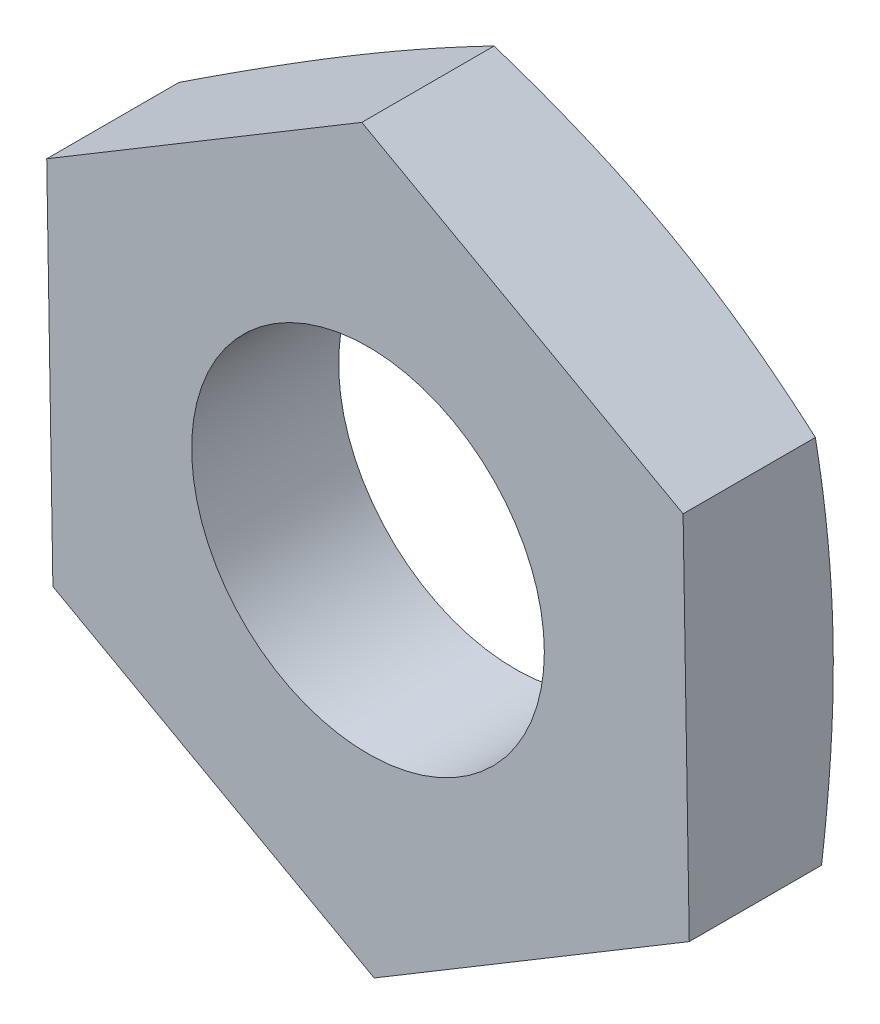
ISO-10303-21;
HEADER;
FILE_DESCRIPTION(('STEP AP214'),'2;1');
FILE_NAME('part.step','',(''),(''),'','','');
FILE_SCHEMA(('AUTOMOTIVE_DESIGN { 1 0 10303 214 1 1 1 1 }'));
ENDSEC;
DATA;
#1=APPLICATION_CONTEXT('core data for automotive mechanical design processes');
#2=APPLICATION_PROTOCOL_DEFINITION('international standard','automotive_design',2000,#1);
#3=PRODUCT_CONTEXT('',#1,'mechanical');
#4=PRODUCT('Part','Part','',(#3));
#5=PRODUCT_RELATED_PRODUCT_CATEGORY('part','',(#4));
#6=PRODUCT_DEFINITION_FORMATION('','',#4);
#7=PRODUCT_DEFINITION_CONTEXT('part definition',#1,'design');
#8=PRODUCT_DEFINITION('design','',#6,#7);
#9=PRODUCT_DEFINITION_SHAPE('','',#8);
#10=(LENGTH_UNIT() NAMED_UNIT(*) SI_UNIT(.MILLI.,.METRE.));
#11=(NAMED_UNIT(*) PLANE_ANGLE_UNIT() SI_UNIT($,.RADIAN.));
#12=(NAMED_UNIT(*) SI_UNIT($,.STERADIAN.) SOLID_ANGLE_UNIT());
#13=UNCERTAINTY_MEASURE_WITH_UNIT(LENGTH_MEASURE(1.E-05),#10,'distance_accuracy_value','');
#14=(GEOMETRIC_REPRESENTATION_CONTEXT(3) GLOBAL_UNCERTAINTY_ASSIGNED_CONTEXT((#13)) GLOBAL_UNIT_ASSIGNED_CONTEXT((#10,
#11,#12)) REPRESENTATION_CONTEXT('',''));
#15=CARTESIAN_POINT('',(0.,0.,0.));
#16=DIRECTION('',(0.,0.,1.));
#17=DIRECTION('',(1.,0.,0.));
#18=AXIS2_PLACEMENT_3D('',#15,#16,#17);
#19=CARTESIAN_POINT('',(0.,0.,0.));
#20=DIRECTION('',(0.,0.,1.));
#21=DIRECTION('',(1.,0.,0.));
#22=AXIS2_PLACEMENT_3D('',#19,#20,#21);
#23=PLANE('',#22);
#24=CARTESIAN_POINT('',(-2.16506350946111,13.8385519997513,0.));
#25=DIRECTION('',(0.,0.,1.));
#26=DIRECTION('',(1.,0.,0.));
#27=AXIS2_PLACEMENT_3D('',#24,#25,#26);
#28=CIRCLE('',#27,6.);
#29=CARTESIAN_POINT('',(3.8349364905389,13.8385519997513,0.));
#30=VERTEX_POINT('',#29);
#31=EDGE_CURVE('E202',#30,#30,#28,.T.);
#32=ORIENTED_EDGE('',*,*,#31,.T.);
#33=EDGE_LOOP('',(#32));
#34=FACE_BOUND('',#33,.T.);
#35=CARTESIAN_POINT('',(-2.16416599208997,13.8401687512004,0.));
#36=DIRECTION('',(0.,0.,-1.));
#37=DIRECTION('',(-1.,0.,0.));
#38=AXIS2_PLACEMENT_3D('',#35,#36,#37);
#39=CIRCLE('',#38,10.825);
#40=CARTESIAN_POINT('',(3.08988609620037,23.3046054303447,0.));
#41=VERTEX_POINT('',#40);
#42=EDGE_CURVE('E255',#41,#41,#39,.T.);
#43=ORIENTED_EDGE('',*,*,#42,.T.);
#44=EDGE_LOOP('',(#43));
#45=FACE_BOUND('',#44,.T.);
#46=ADVANCED_FACE('F33',(#34,#45),#23,.F.);
#47=CARTESIAN_POINT('',(0.,0.,5.));
#48=DIRECTION('',(0.,0.,1.));
#49=DIRECTION('',(1.,0.,0.));
#50=AXIS2_PLACEMENT_3D('',#47,#48,#49);
#51=PLANE('',#50);
#52=DIRECTION('',(0.0168199314832365,-0.999858534946269,0.));
#53=VECTOR('',#52,1.);
#54=CARTESIAN_POINT('',(-13.0955205020941,19.9064451385644,5.));
#55=LINE('',#54,#53);
#56=CARTESIAN_POINT('',(-13.0955205020941,19.9064451385644,5.));
#57=VERTEX_POINT('',#56);
#58=CARTESIAN_POINT('',(-12.8852416114391,7.40644513856439,5.));
#59=VERTEX_POINT('',#58);
#60=EDGE_CURVE('E151',#57,#59,#55,.T.);
#61=ORIENTED_EDGE('',*,*,#60,.T.);
#62=DIRECTION('',(0.874312857195778,-0.485362779518738,0.));
#63=VECTOR('',#62,1.);
#64=CARTESIAN_POINT('',(-12.8852416114391,7.40644513856439,5.));
#65=LINE('',#64,#63);
#66=CARTESIAN_POINT('',(-1.95478461880609,1.33855199975125,5.));
#67=VERTEX_POINT('',#66);
#68=EDGE_CURVE('E145',#59,#67,#65,.T.);
#69=ORIENTED_EDGE('',*,*,#68,.T.);
#70=DIRECTION('',(0.857492925712541,0.514495755427531,0.));
#71=VECTOR('',#70,1.);
#72=CARTESIAN_POINT('',(-1.95478461880609,1.33855199975125,5.));
#73=LINE('',#72,#71);
#74=CARTESIAN_POINT('',(8.76539348317189,7.77065886093812,5.));
#75=VERTEX_POINT('',#74);
#76=EDGE_CURVE('E245',#67,#75,#73,.T.);
#77=ORIENTED_EDGE('',*,*,#76,.T.);
#78=DIRECTION('',(-0.0168199314832367,0.999858534946269,0.));
#79=VECTOR('',#78,1.);
#80=CARTESIAN_POINT('',(8.76539348317189,7.77065886093812,5.));
#81=LINE('',#80,#79);
#82=CARTESIAN_POINT('',(8.55511459251686,20.2706588609381,5.));
#83=VERTEX_POINT('',#82);
#84=EDGE_CURVE('E129',#75,#83,#81,.T.);
#85=ORIENTED_EDGE('',*,*,#84,.T.);
#86=DIRECTION('',(-0.874312857195778,0.485362779518738,0.));
#87=VECTOR('',#86,1.);
#88=CARTESIAN_POINT('',(8.55511459251686,20.2706588609381,5.));
#89=LINE('',#88,#87);
#90=CARTESIAN_POINT('',(-2.37534240011613,26.3385519997513,5.));
#91=VERTEX_POINT('',#90);
#92=EDGE_CURVE('E242',#83,#91,#89,.T.);
#93=ORIENTED_EDGE('',*,*,#92,.T.);
#94=DIRECTION('',(-0.857492925712541,-0.514495755427531,0.));
#95=VECTOR('',#94,1.);
#96=CARTESIAN_POINT('',(-2.37534240011613,26.3385519997513,5.));
#97=LINE('',#96,#95);
#98=EDGE_CURVE('E236',#91,#57,#97,.T.);
#99=ORIENTED_EDGE('',*,*,#98,.T.);
#100=EDGE_LOOP('',(#61,#69,#77,#85,#93,#99));
#101=FACE_BOUND('',#100,.T.);
#102=CARTESIAN_POINT('',(-2.16506350946111,13.8385519997513,5.));
#103=DIRECTION('',(0.,0.,1.));
#104=DIRECTION('',(1.,0.,0.));
#105=AXIS2_PLACEMENT_3D('',#102,#103,#104);
#106=CIRCLE('',#105,6.);
#107=CARTESIAN_POINT('',(3.8349364905389,13.8385519997513,5.));
#108=VERTEX_POINT('',#107);
#109=EDGE_CURVE('E203',#108,#108,#106,.T.);
#110=ORIENTED_EDGE('',*,*,#109,.F.);
#111=EDGE_LOOP('',(#110));
#112=FACE_BOUND('',#111,.T.);
#113=ADVANCED_FACE('F216',(#101,#112),#51,.T.);
#114=CARTESIAN_POINT('',(-13.0955205020941,19.9064451385644,5.));
#115=DIRECTION('',(0.999858534946269,0.0168199314832365,0.));
#116=DIRECTION('',(-0.0168199314832365,0.999858534946269,0.));
#117=AXIS2_PLACEMENT_3D('',#114,#115,#116);
#118=PLANE('',#117);
#119=DIRECTION('',(0.,0.,-1.));
#120=VECTOR('',#119,1.);
#121=CARTESIAN_POINT('',(-13.0955205020941,19.9064451385644,5.));
#122=LINE('',#121,#120);
#123=CARTESIAN_POINT('',(-13.0955205020941,19.9064451385644,0.5));
#124=VERTEX_POINT('',#123);
#125=EDGE_CURVE('E238',#57,#124,#122,.T.);
#126=ORIENTED_EDGE('',*,*,#125,.T.);
#127=CARTESIAN_POINT('',(-13.0955238665563,19.9066451385644,0.50002985697749));
#128=CARTESIAN_POINT('',(-13.0867995313924,19.3880282236201,0.422684675104094));
#129=CARTESIAN_POINT('',(-13.0780556906255,18.8682518007651,0.352429876257374));
#130=CARTESIAN_POINT('',(-13.060529807607,17.8264280730086,0.228954287126737));
#131=CARTESIAN_POINT('',(-13.0517477482138,17.3043797491228,0.175742163456824));
#132=CARTESIAN_POINT('',(-13.0342111932582,16.261921629519,0.0895651849645063));
#133=CARTESIAN_POINT('',(-13.0254568789745,15.7415226098837,0.0564733955933078));
#134=CARTESIAN_POINT('',(-13.0079344601726,14.6999048120091,0.0121028578918939));
#135=CARTESIAN_POINT('',(-12.9991663595205,14.1786862635855,0.000818813274274054));
#136=CARTESIAN_POINT('',(-12.9816301687857,13.1362497950373,0.000835420746450474));
#137=CARTESIAN_POINT('',(-12.9728620787031,12.6150318749124,0.0121360615570773));
#138=CARTESIAN_POINT('',(-12.9553396915242,11.5734159568656,0.0565386514262699));
#139=CARTESIAN_POINT('',(-12.9465853982971,11.0530181889389,0.0896458970614779));
#140=CARTESIAN_POINT('',(-12.9290488917792,10.0105629487034,0.17585195486682));
#141=CARTESIAN_POINT('',(-12.9202668598116,9.48851625513203,0.229077690330715));
#142=CARTESIAN_POINT('',(-12.9027410354596,8.44669601479544,0.352578329386825));
#143=CARTESIAN_POINT('',(-12.8939972259279,7.92692144871135,0.422844565314163));
#144=CARTESIAN_POINT('',(-12.8852729213389,7.40830635129441,0.500200000000001));
#145=B_SPLINE_CURVE_WITH_KNOTS('',3,(#127,#128,#129,#130,#131,#132,#133,#134,#135,#136,#137,
#138,#139,#140,#141,#142,#143,#144),.UNSPECIFIED.,.F.,.F.,(4,2,2,2,2,2,2,2,4),(0.,
1.57337984366562,3.14755852346243,4.71170014225027,6.27546184164752,7.83922276007622,
9.40336363840265,10.9775416645261,12.5509206569255),.UNSPECIFIED.);
#146=CARTESIAN_POINT('',(-12.8852954878106,7.40964781212835,0.5));
#147=VERTEX_POINT('',#146);
#148=EDGE_CURVE('E63',#124,#147,#145,.T.);
#149=ORIENTED_EDGE('',*,*,#148,.T.);
#150=DIRECTION('',(0.0168199314832365,-0.999858534946269,0.));
#151=VECTOR('',#150,1.);
#152=CARTESIAN_POINT('',(-13.0955205020941,19.9064451385644,0.5));
#153=LINE('',#152,#151);
#154=CARTESIAN_POINT('',(-12.8852416114391,7.40644513856439,0.5));
#155=VERTEX_POINT('',#154);
#156=EDGE_CURVE('E152',#147,#155,#153,.T.);
#157=ORIENTED_EDGE('',*,*,#156,.T.);
#158=DIRECTION('',(0.,0.,-1.));
#159=VECTOR('',#158,1.);
#160=CARTESIAN_POINT('',(-12.8852416114391,7.40644513856439,5.));
#161=LINE('',#160,#159);
#162=EDGE_CURVE('E48',#59,#155,#161,.T.);
#163=ORIENTED_EDGE('',*,*,#162,.F.);
#164=ORIENTED_EDGE('',*,*,#60,.F.);
#165=EDGE_LOOP('',(#126,#149,#157,#163,#164));
#166=FACE_BOUND('',#165,.T.);
#167=ADVANCED_FACE('F35',(#166),#118,.F.);
#168=CARTESIAN_POINT('',(-12.8852416114391,7.40644513856439,5.));
#169=DIRECTION('',(0.485362779518738,0.874312857195778,0.));
#170=DIRECTION('',(-0.874312857195778,0.485362779518738,0.));
#171=AXIS2_PLACEMENT_3D('',#168,#169,#170);
#172=PLANE('',#171);
#173=ORIENTED_EDGE('',*,*,#162,.T.);
#174=DIRECTION('',(0.874312857195778,-0.485362779518738,0.));
#175=VECTOR('',#174,1.);
#176=CARTESIAN_POINT('',(-12.8852416114391,7.40644513856439,0.5));
#177=LINE('',#176,#175);
#178=CARTESIAN_POINT('',(-12.8824403587444,7.40489006158841,0.5));
#179=VERTEX_POINT('',#178);
#180=EDGE_CURVE('E143',#155,#179,#177,.T.);
#181=ORIENTED_EDGE('',*,*,#180,.T.);
#182=CARTESIAN_POINT('',(-12.8836136819032,7.40554141583187,0.5002));
#183=CARTESIAN_POINT('',(-12.4301911136307,7.15383010194462,0.422876824913314));
#184=CARTESIAN_POINT('',(-11.9757550818385,6.90155617769791,0.352642014883943));
#185=CARTESIAN_POINT('',(-11.0648982929762,6.39590653621412,0.229200372325145));
#186=CARTESIAN_POINT('',(-10.6084766459393,6.14253032492415,0.176002196908478));
#187=CARTESIAN_POINT('',(-9.69706510826565,5.63657272225372,0.0898448181855448));
#188=CARTESIAN_POINT('',(-9.24208463207512,5.38399655717377,0.0567587862919687));
#189=CARTESIAN_POINT('',(-8.33140700847794,4.87844637682721,0.012390430293197));
#190=CARTESIAN_POINT('',(-7.87571006180026,4.62547247299252,0.00110281653961971));
#191=CARTESIAN_POINT('',(-6.9643161684449,4.11952466532313,0.00110281653961985));
#192=CARTESIAN_POINT('',(-6.50861922176721,3.86655076148843,0.0123904302931973));
#193=CARTESIAN_POINT('',(-5.59794159817004,3.36100058114187,0.05675878629197));
#194=CARTESIAN_POINT('',(-5.1429611219795,3.10842441606193,0.089844818185547));
#195=CARTESIAN_POINT('',(-4.23154958430588,2.60246681339149,0.176002196908481));
#196=CARTESIAN_POINT('',(-3.77512793726893,2.34909060210152,0.229200372325147));
#197=CARTESIAN_POINT('',(-2.86427114840664,1.84344096061773,0.352642014883946));
#198=CARTESIAN_POINT('',(-2.40983511661443,1.59116703637102,0.422876824913317));
#199=CARTESIAN_POINT('',(-1.95641254834195,1.33945572248378,0.500200000000003));
#200=B_SPLINE_CURVE_WITH_KNOTS('',3,(#182,#183,#184,#185,#186,#187,#188,#189,#190,#191,#192,
#193,#194,#195,#196,#197,#198,#199),.UNSPECIFIED.,.F.,.F.,(4,2,2,2,2,2,2,2,4),(0.,
1.57311538337115,3.14702887668031,4.71091131489419,6.27441421051308,7.83791710613197,
9.40179954434585,10.975713037655,12.5488284210262),.UNSPECIFIED.);
#201=CARTESIAN_POINT('',(-1.9575858715008,1.34010707672725,0.5));
#202=VERTEX_POINT('',#201);
#203=EDGE_CURVE('E196',#179,#202,#200,.T.);
#204=ORIENTED_EDGE('',*,*,#203,.T.);
#205=CARTESIAN_POINT('',(-1.95478461880609,1.33855199975125,0.5));
#206=VERTEX_POINT('',#205);
#207=EDGE_CURVE('E158',#202,#206,#177,.T.);
#208=ORIENTED_EDGE('',*,*,#207,.T.);
#209=DIRECTION('',(0.,0.,-1.));
#210=VECTOR('',#209,1.);
#211=CARTESIAN_POINT('',(-1.95478461880609,1.33855199975125,5.));
#212=LINE('',#211,#210);
#213=EDGE_CURVE('E130',#67,#206,#212,.T.);
#214=ORIENTED_EDGE('',*,*,#213,.F.);
#215=ORIENTED_EDGE('',*,*,#68,.F.);
#216=EDGE_LOOP('',(#173,#181,#204,#208,#214,#215));
#217=FACE_BOUND('',#216,.T.);
#218=ADVANCED_FACE('F141',(#217),#172,.F.);
#219=CARTESIAN_POINT('',(-1.95478461880609,1.33855199975125,5.));
#220=DIRECTION('',(-0.514495755427531,0.857492925712541,0.));
#221=DIRECTION('',(-0.857492925712542,-0.514495755427531,0.));
#222=AXIS2_PLACEMENT_3D('',#219,#220,#221);
#223=PLANE('',#222);
#224=DIRECTION('',(0.857492925712542,0.514495755427531,0.));
#225=VECTOR('',#224,1.);
#226=CARTESIAN_POINT('',(-1.95478461880609,1.33855199975125,0.5));
#227=LINE('',#226,#225);
#228=CARTESIAN_POINT('',(-1.95203796032542,1.34019999483965,0.5));
#229=VERTEX_POINT('',#228);
#230=EDGE_CURVE('E126',#206,#229,#227,.T.);
#231=ORIENTED_EDGE('',*,*,#230,.T.);
#232=CARTESIAN_POINT('',(-1.95318841624998,1.33950972128492,0.500200000000005));
#233=CARTESIAN_POINT('',(-1.50841552128261,1.60637345826534,0.422844356453918));
#234=CARTESIAN_POINT('',(-1.06264824354395,1.87383382490854,0.352577950441473));
#235=CARTESIAN_POINT('',(-0.169165942782842,2.40992320536521,0.229077070746257));
#236=CARTESIAN_POINT('',(0.278549954431254,2.67855274369367,0.175851264827393));
#237=CARTESIAN_POINT('',(1.17257683568901,3.21496887244833,0.08964518964693));
#238=CARTESIAN_POINT('',(1.61887857565739,3.48274991642937,0.0565379957478577));
#239=CARTESIAN_POINT('',(2.5121856243692,4.01873414565646,0.0121356386944393));
#240=CARTESIAN_POINT('',(2.95919073586435,4.28693721255355,0.000835178890827336));
#241=CARTESIAN_POINT('',(3.8532014820175,4.82334366024545,0.000819054601660142));
#242=CARTESIAN_POINT('',(4.30020711667564,5.09154704104034,0.0121034010672146));
#243=CARTESIAN_POINT('',(5.19351573065525,5.62753220942811,0.0564746384946488));
#244=CARTESIAN_POINT('',(5.63981851287773,5.8953138787616,0.0895668258249717));
#245=CARTESIAN_POINT('',(6.53384779168371,6.4317314460452,0.175744667754441));
#246=CARTESIAN_POINT('',(6.98156504640238,6.7003617988764,0.228957257918732));
#247=CARTESIAN_POINT('',(7.87505025101229,7.23645292164235,0.352433816532551));
#248=CARTESIAN_POINT('',(8.32081907481651,7.50391421592488,0.422689118238471));
#249=CARTESIAN_POINT('',(8.76559348317189,7.77077886093812,0.500034807293));
#250=B_SPLINE_CURVE_WITH_KNOTS('',3,(#232,#233,#234,#235,#236,#237,#238,#239,#240,#241,#242,
#243,#244,#245,#246,#247,#248,#249),.UNSPECIFIED.,.F.,.F.,(4,2,2,2,2,2,2,2,4),(0.,
1.57338323193201,3.14756550419713,4.71171055662652,6.27547564518754,7.83924149200022,
9.4033872633525,10.9775701702768,12.550954228713),.UNSPECIFIED.);
#251=CARTESIAN_POINT('',(8.76539347857256,7.77065913434451,0.5));
#252=VERTEX_POINT('',#251);
#253=EDGE_CURVE('E111',#229,#252,#250,.T.);
#254=ORIENTED_EDGE('',*,*,#253,.T.);
#255=DIRECTION('',(0.,0.,-1.));
#256=VECTOR('',#255,1.);
#257=CARTESIAN_POINT('',(8.76539348317189,7.77065886093812,5.));
#258=LINE('',#257,#256);
#259=EDGE_CURVE('E123',#75,#252,#258,.T.);
#260=ORIENTED_EDGE('',*,*,#259,.F.);
#261=ORIENTED_EDGE('',*,*,#76,.F.);
#262=ORIENTED_EDGE('',*,*,#213,.T.);
#263=EDGE_LOOP('',(#231,#254,#260,#261,#262));
#264=FACE_BOUND('',#263,.T.);
#265=ADVANCED_FACE('F121',(#264),#223,.F.);
#266=CARTESIAN_POINT('',(8.76539348317189,7.77065886093812,5.));
#267=DIRECTION('',(-0.999858534946269,-0.0168199314832367,0.));
#268=DIRECTION('',(0.0168199314832367,-0.999858534946269,0.));
#269=AXIS2_PLACEMENT_3D('',#266,#267,#268);
#270=PLANE('',#269);
#271=ORIENTED_EDGE('',*,*,#259,.T.);
#272=CARTESIAN_POINT('',(8.76539684763414,7.77045886093812,0.500029872258444));
#273=CARTESIAN_POINT('',(8.75667114727167,8.2891569299224,0.422633147690996));
#274=CARTESIAN_POINT('',(8.74792593243303,8.80901503428311,0.352326063072702));
#275=CARTESIAN_POINT('',(8.73039726739171,9.85100413900928,0.228747427893326));
#276=CARTESIAN_POINT('',(8.72161380000619,10.3731361608066,0.175484558915394));
#277=CARTESIAN_POINT('',(8.7040744376521,11.4157611658331,0.0892112975061097));
#278=CARTESIAN_POINT('',(8.6953187242878,11.9362433536207,0.056073864501526));
#279=CARTESIAN_POINT('',(8.67779347707662,12.9780292859005,0.0116203937621829));
#280=CARTESIAN_POINT('',(8.66902394710927,13.4993327997739,0.000299050381241432));
#281=CARTESIAN_POINT('',(8.65148485748826,14.5419415922196,0.00025243043891354));
#282=CARTESIAN_POINT('',(8.64271529783457,15.0632468707935,0.011527185576569));
#283=CARTESIAN_POINT('',(8.62518996181266,16.1050380824148,0.0558906827179348));
#284=CARTESIAN_POINT('',(8.6164341893155,16.6255237853475,0.0889847295557887));
#285=CARTESIAN_POINT('',(8.5988946909454,17.668156875827,0.17517636756357));
#286=CARTESIAN_POINT('',(8.59011114655131,18.1902934753881,0.228401030936762));
#287=CARTESIAN_POINT('',(8.57258231678901,19.2322923719309,0.351909359105747));
#288=CARTESIAN_POINT('',(8.56383701425377,19.7521556894041,0.422184345268381));
#289=CARTESIAN_POINT('',(8.55511122805461,20.2708588609381,0.499552296644255));
#290=B_SPLINE_CURVE_WITH_KNOTS('',3,(#272,#273,#274,#275,#276,#277,#278,#279,#280,#281,#282,
#283,#284,#285,#286,#287,#288,#289),.UNSPECIFIED.,.F.,.F.,(4,2,2,2,2,2,2,2,4),(0.,
1.57364365229737,3.14808757916713,4.71248673027026,6.27650537338224,7.84052621058659,
9.4049274419988,10.9793732053093,12.5530192490684),.UNSPECIFIED.);
#291=CARTESIAN_POINT('',(8.55511459251686,20.2706588609381,0.499522476626818));
#292=VERTEX_POINT('',#291);
#293=EDGE_CURVE('E107',#252,#292,#290,.T.);
#294=ORIENTED_EDGE('',*,*,#293,.T.);
#295=DIRECTION('',(0.,0.,-1.));
#296=VECTOR('',#295,1.);
#297=CARTESIAN_POINT('',(8.55511459251686,20.2706588609381,5.));
#298=LINE('',#297,#296);
#299=EDGE_CURVE('E131',#83,#292,#298,.T.);
#300=ORIENTED_EDGE('',*,*,#299,.F.);
#301=ORIENTED_EDGE('',*,*,#84,.F.);
#302=EDGE_LOOP('',(#271,#294,#300,#301));
#303=FACE_BOUND('',#302,.T.);
#304=ADVANCED_FACE('F128',(#303),#270,.F.);
#305=CARTESIAN_POINT('',(8.55511459251686,20.2706588609381,5.));
#306=DIRECTION('',(-0.485362779518738,-0.874312857195778,0.));
#307=DIRECTION('',(0.874312857195778,-0.485362779518738,0.));
#308=AXIS2_PLACEMENT_3D('',#305,#306,#307);
#309=PLANE('',#308);
#310=ORIENTED_EDGE('',*,*,#299,.T.);
#311=CARTESIAN_POINT('',(8.55531459251686,20.2705478336838,0.499556587403594));
#312=CARTESIAN_POINT('',(8.10174193760862,20.5223424661064,0.422168724583471));
#313=CARTESIAN_POINT('',(7.64715475590999,20.7747002991486,0.35187228838985));
#314=CARTESIAN_POINT('',(6.73599287360754,21.2805193090672,0.228318849894168));
#315=CARTESIAN_POINT('',(6.27941727984777,21.5339809817668,0.175070530839378));
#316=CARTESIAN_POINT('',(5.36770002852507,22.0401082971725,0.0888305174944178));
#317=CARTESIAN_POINT('',(4.91256781061491,22.2927686995849,0.0557117376450822));
#318=CARTESIAN_POINT('',(4.00158562617561,22.7984879527018,0.0112991325956014));
#319=CARTESIAN_POINT('',(3.54573586118799,23.0515466915232,0.));
#320=CARTESIAN_POINT('',(2.63403633121275,23.5576641691662,0.));
#321=CARTESIAN_POINT('',(2.17818656622513,23.8107229079876,0.0112991325956013));
#322=CARTESIAN_POINT('',(1.26720438178583,24.3164421611045,0.0557117376450823));
#323=CARTESIAN_POINT('',(0.812072163875668,24.5691025635168,0.088830517494418));
#324=CARTESIAN_POINT('',(-0.0996450874470287,25.0752298789225,0.175070530839378));
#325=CARTESIAN_POINT('',(-0.5562206812068,25.3286915516222,0.228318849894168));
#326=CARTESIAN_POINT('',(-1.46738256350925,25.8345105615408,0.35187228838985));
#327=CARTESIAN_POINT('',(-1.92196974520788,26.0868683945829,0.422168724583471));
#328=CARTESIAN_POINT('',(-2.37554240011613,26.3386630270055,0.499556587403594));
#329=B_SPLINE_CURVE_WITH_KNOTS('',3,(#311,#312,#313,#314,#315,#316,#317,#318,#319,#320,#321,
#322,#323,#324,#325,#326,#327,#328),.UNSPECIFIED.,.F.,.F.,(4,2,2,2,2,2,2,2,4),(0.,
1.57365367347809,3.14810759752801,4.71251524016168,6.27654230943999,7.8405693787183,
9.40497702135197,10.9794309454019,12.55308461888),.UNSPECIFIED.);
#330=EDGE_CURVE('E55',#292,#41,#329,.T.);
#331=ORIENTED_EDGE('',*,*,#330,.T.);
#332=CARTESIAN_POINT('',(-2.37534240011613,26.3385519997513,0.499522476626817));
#333=VERTEX_POINT('',#332);
#334=EDGE_CURVE('E155',#41,#333,#329,.T.);
#335=ORIENTED_EDGE('',*,*,#334,.T.);
#336=DIRECTION('',(0.,0.,-1.));
#337=VECTOR('',#336,1.);
#338=CARTESIAN_POINT('',(-2.37534240011613,26.3385519997513,5.));
#339=LINE('',#338,#337);
#340=EDGE_CURVE('E134',#91,#333,#339,.T.);
#341=ORIENTED_EDGE('',*,*,#340,.F.);
#342=ORIENTED_EDGE('',*,*,#92,.F.);
#343=EDGE_LOOP('',(#310,#331,#335,#341,#342));
#344=FACE_BOUND('',#343,.T.);
#345=ADVANCED_FACE('F171',(#344),#309,.F.);
#346=CARTESIAN_POINT('',(-2.37534240011613,26.3385519997513,5.));
#347=DIRECTION('',(0.514495755427531,-0.857492925712542,0.));
#348=DIRECTION('',(0.857492925712542,0.514495755427531,0.));
#349=AXIS2_PLACEMENT_3D('',#346,#347,#348);
#350=PLANE('',#349);
#351=ORIENTED_EDGE('',*,*,#340,.T.);
#352=CARTESIAN_POINT('',(-2.37514240011613,26.3386719997513,0.499557247593987));
#353=CARTESIAN_POINT('',(-2.819991981477,26.0717622509347,0.422188580086464));
#354=CARTESIAN_POINT('',(-3.26583653139432,25.8042555209843,0.351912920889571));
#355=CARTESIAN_POINT('',(-4.15947438192186,25.2680728106678,0.228403382450505));
#356=CARTESIAN_POINT('',(-4.6072685577471,24.9993963051727,0.175178182070361));
#357=CARTESIAN_POINT('',(-5.50145030827294,24.4628872548571,0.0889856632032773));
#358=CARTESIAN_POINT('',(-5.94782863082411,24.1950602613264,0.0558912701509907));
#359=CARTESIAN_POINT('',(-6.84128836321336,23.6589844218929,0.0115273061993012));
#360=CARTESIAN_POINT('',(-7.28836957569494,23.3907356944039,0.000252430311892406));
#361=CARTESIAN_POINT('',(-8.18253048720323,22.8542391474989,0.000299050508277576));
#362=CARTESIAN_POINT('',(-8.62961018623118,22.5859913280822,0.0116205148922784));
#363=CARTESIAN_POINT('',(-9.52306539092534,22.0499182052657,0.0560744528977621));
#364=CARTESIAN_POINT('',(-9.96944069880274,21.7820930205392,0.0892122323192955));
#365=CARTESIAN_POINT('',(-10.863615515056,21.2455881307873,0.175486374920662));
#366=CARTESIAN_POINT('',(-11.3114057648881,20.976913980888,0.228749781035077));
#367=CARTESIAN_POINT('',(-12.2050352177406,20.4407363091765,0.352329626672883));
#368=CARTESIAN_POINT('',(-12.6508752967825,20.1732322617514,0.422637384384239));
#369=CARTESIAN_POINT('',(-13.0957205020941,19.9063251385644,0.50003482511095));
#370=B_SPLINE_CURVE_WITH_KNOTS('',3,(#352,#353,#354,#355,#356,#357,#358,#359,#360,#361,#362,
#363,#364,#365,#366,#367,#368,#369),.UNSPECIFIED.,.F.,.F.,(4,2,2,2,2,2,2,2,4),(0.,
1.57365449816539,3.14810873486229,4.71251829299011,6.27654744778221,7.84057440844176,
9.4049818862221,10.979434286445,12.5530863931068),.UNSPECIFIED.);
#371=EDGE_CURVE('E11',#333,#124,#370,.T.);
#372=ORIENTED_EDGE('',*,*,#371,.T.);
#373=ORIENTED_EDGE('',*,*,#125,.F.);
#374=ORIENTED_EDGE('',*,*,#98,.F.);
#375=EDGE_LOOP('',(#351,#372,#373,#374));
#376=FACE_BOUND('',#375,.T.);
#377=ADVANCED_FACE('F214',(#376),#350,.F.);
#378=CARTESIAN_POINT('',(-2.16506350946111,13.8385519997513,5.));
#379=DIRECTION('',(0.,0.,-1.));
#380=DIRECTION('',(-1.,0.,0.));
#381=AXIS2_PLACEMENT_3D('',#378,#379,#380);
#382=CYLINDRICAL_SURFACE('',#381,6.);
#383=ORIENTED_EDGE('',*,*,#109,.T.);
#384=EDGE_LOOP('',(#383));
#385=FACE_BOUND('',#384,.T.);
#386=ORIENTED_EDGE('',*,*,#31,.F.);
#387=EDGE_LOOP('',(#386));
#388=FACE_BOUND('',#387,.T.);
#389=ADVANCED_FACE('F178',(#385,#388),#382,.F.);
#390=CARTESIAN_POINT('',(-2.16416599208997,13.8401687512004,0.5));
#391=DIRECTION('',(0.,0.,1.));
#392=DIRECTION('',(1.,0.,0.));
#393=AXIS2_PLACEMENT_3D('',#390,#391,#392);
#394=CONICAL_SURFACE('',#393,12.5017685633615,1.28099850887761);
#395=CARTESIAN_POINT('',(-2.16416599208997,13.8401687512004,0.5));
#396=DIRECTION('',(0.,0.,-1.));
#397=DIRECTION('',(-1.,0.,0.));
#398=AXIS2_PLACEMENT_3D('',#395,#396,#397);
#399=CIRCLE('',#398,12.5017685633615);
#400=EDGE_CURVE('E260',#179,#147,#399,.T.);
#401=ORIENTED_EDGE('',*,*,#400,.T.);
#402=ORIENTED_EDGE('',*,*,#148,.F.);
#403=ORIENTED_EDGE('',*,*,#371,.F.);
#404=ORIENTED_EDGE('',*,*,#334,.F.);
#405=ORIENTED_EDGE('',*,*,#42,.F.);
#406=ORIENTED_EDGE('',*,*,#330,.F.);
#407=ORIENTED_EDGE('',*,*,#293,.F.);
#408=ORIENTED_EDGE('',*,*,#253,.F.);
#409=EDGE_CURVE('E257',#229,#202,#399,.T.);
#410=ORIENTED_EDGE('',*,*,#409,.T.);
#411=ORIENTED_EDGE('',*,*,#203,.F.);
#412=EDGE_LOOP('',(#401,#402,#403,#404,#405,#406,#407,#408,#410,#411));
#413=FACE_BOUND('',#412,.T.);
#414=ADVANCED_FACE('F109',(#413),#394,.T.);
#415=CARTESIAN_POINT('',(-13.094622984723,19.9080618900135,0.5));
#416=DIRECTION('',(0.,0.,1.));
#417=DIRECTION('',(1.,0.,0.));
#418=AXIS2_PLACEMENT_3D('',#415,#416,#417);
#419=PLANE('',#418);
#420=ORIENTED_EDGE('',*,*,#400,.F.);
#421=ORIENTED_EDGE('',*,*,#180,.F.);
#422=ORIENTED_EDGE('',*,*,#156,.F.);
#423=EDGE_LOOP('',(#420,#421,#422));
#424=FACE_BOUND('',#423,.T.);
#425=ADVANCED_FACE('F177',(#424),#419,.F.);
#426=ORIENTED_EDGE('',*,*,#409,.F.);
#427=ORIENTED_EDGE('',*,*,#230,.F.);
#428=ORIENTED_EDGE('',*,*,#207,.F.);
#429=EDGE_LOOP('',(#426,#427,#428));
#430=FACE_BOUND('',#429,.T.);
#431=ADVANCED_FACE('F261',(#430),#419,.F.);
#432=CLOSED_SHELL('',(#46,#113,#167,#218,#265,#304,#345,#377,#389,#414,#425,#431));
#433=MANIFOLD_SOLID_BREP('B2',#432);
#434=ADVANCED_BREP_SHAPE_REPRESENTATION('',(#18,#433),#14);
#435=SHAPE_DEFINITION_REPRESENTATION(#9,#434);
ENDSEC;
END-ISO-10303-21;
